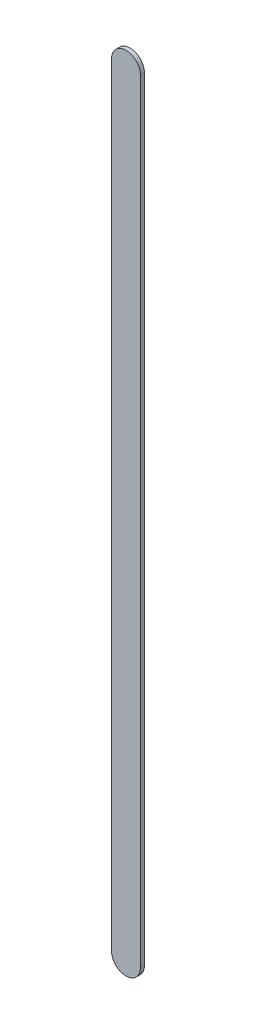
ISO-10303-21;
HEADER;
FILE_DESCRIPTION(('STEP AP214'),'2;1');
FILE_NAME('part.step','',(''),(''),'','','');
FILE_SCHEMA(('AUTOMOTIVE_DESIGN { 1 0 10303 214 1 1 1 1 }'));
ENDSEC;
DATA;
#1=APPLICATION_CONTEXT('core data for automotive mechanical design processes');
#2=APPLICATION_PROTOCOL_DEFINITION('international standard','automotive_design',2000,#1);
#3=PRODUCT_CONTEXT('',#1,'mechanical');
#4=PRODUCT('Part','Part','',(#3));
#5=PRODUCT_RELATED_PRODUCT_CATEGORY('part','',(#4));
#6=PRODUCT_DEFINITION_FORMATION('','',#4);
#7=PRODUCT_DEFINITION_CONTEXT('part definition',#1,'design');
#8=PRODUCT_DEFINITION('design','',#6,#7);
#9=PRODUCT_DEFINITION_SHAPE('','',#8);
#10=(LENGTH_UNIT() NAMED_UNIT(*) SI_UNIT(.MILLI.,.METRE.));
#11=(NAMED_UNIT(*) PLANE_ANGLE_UNIT() SI_UNIT($,.RADIAN.));
#12=(NAMED_UNIT(*) SI_UNIT($,.STERADIAN.) SOLID_ANGLE_UNIT());
#13=UNCERTAINTY_MEASURE_WITH_UNIT(LENGTH_MEASURE(1.E-05),#10,'distance_accuracy_value','');
#14=(GEOMETRIC_REPRESENTATION_CONTEXT(3) GLOBAL_UNCERTAINTY_ASSIGNED_CONTEXT((#13)) GLOBAL_UNIT_ASSIGNED_CONTEXT((#10,
#11,#12)) REPRESENTATION_CONTEXT('',''));
#15=CARTESIAN_POINT('',(0.,0.,0.));
#16=DIRECTION('',(0.,0.,1.));
#17=DIRECTION('',(1.,0.,0.));
#18=AXIS2_PLACEMENT_3D('',#15,#16,#17);
#19=CARTESIAN_POINT('',(86.7970197,94.13392654,0.));
#20=DIRECTION('',(-1.,0.,0.));
#21=DIRECTION('',(0.,1.,0.));
#22=AXIS2_PLACEMENT_3D('',#19,#20,#21);
#23=PLANE('',#22);
#24=DIRECTION('',(0.,1.,0.));
#25=VECTOR('',#24,1.);
#26=CARTESIAN_POINT('',(86.7970197,94.13392654,0.03556));
#27=LINE('',#26,#25);
#28=CARTESIAN_POINT('',(86.7970197,94.13392654,0.03556));
#29=VERTEX_POINT('',#28);
#30=CARTESIAN_POINT('',(86.7970197,100.93553854,0.03556));
#31=VERTEX_POINT('',#30);
#32=EDGE_CURVE('E11',#29,#31,#27,.T.);
#33=ORIENTED_EDGE('',*,*,#32,.F.);
#34=DIRECTION('',(0.,0.,1.));
#35=VECTOR('',#34,1.);
#36=CARTESIAN_POINT('',(86.7970197,94.13392654,0.));
#37=LINE('',#36,#35);
#38=CARTESIAN_POINT('',(86.7970197,94.13392654,0.));
#39=VERTEX_POINT('',#38);
#40=EDGE_CURVE('E24',#39,#29,#37,.T.);
#41=ORIENTED_EDGE('',*,*,#40,.F.);
#42=DIRECTION('',(0.,1.,0.));
#43=VECTOR('',#42,1.);
#44=CARTESIAN_POINT('',(86.7970197,94.13392654,0.));
#45=LINE('',#44,#43);
#46=CARTESIAN_POINT('',(86.7970197,100.93553854,0.));
#47=VERTEX_POINT('',#46);
#48=EDGE_CURVE('E75',#39,#47,#45,.T.);
#49=ORIENTED_EDGE('',*,*,#48,.T.);
#50=DIRECTION('',(0.,0.,1.));
#51=VECTOR('',#50,1.);
#52=CARTESIAN_POINT('',(86.7970197,100.93553854,0.));
#53=LINE('',#52,#51);
#54=EDGE_CURVE('E37',#47,#31,#53,.T.);
#55=ORIENTED_EDGE('',*,*,#54,.T.);
#56=EDGE_LOOP('',(#33,#41,#49,#55));
#57=FACE_BOUND('',#56,.T.);
#58=ADVANCED_FACE('F17',(#57),#23,.F.);
#59=CARTESIAN_POINT('',(86.6700197,100.93553854,0.));
#60=DIRECTION('',(0.,0.,-1.));
#61=DIRECTION('',(1.,1.1189649382048E-13,0.));
#62=AXIS2_PLACEMENT_3D('',#59,#60,#61);
#63=CYLINDRICAL_SURFACE('',#62,0.127000000000005);
#64=CARTESIAN_POINT('',(86.6700197,100.93553854,0.03556));
#65=DIRECTION('',(0.,0.,1.));
#66=DIRECTION('',(1.,1.1189649382048E-13,0.));
#67=AXIS2_PLACEMENT_3D('',#64,#65,#66);
#68=CIRCLE('',#67,0.127000000000005);
#69=CARTESIAN_POINT('',(86.5430197,100.93553854,0.03556));
#70=VERTEX_POINT('',#69);
#71=EDGE_CURVE('E83',#31,#70,#68,.T.);
#72=ORIENTED_EDGE('',*,*,#71,.F.);
#73=ORIENTED_EDGE('',*,*,#54,.F.);
#74=CARTESIAN_POINT('',(86.6700197,100.93553854,0.));
#75=DIRECTION('',(0.,0.,1.));
#76=DIRECTION('',(1.,1.1189649382048E-13,0.));
#77=AXIS2_PLACEMENT_3D('',#74,#75,#76);
#78=CIRCLE('',#77,0.127000000000005);
#79=CARTESIAN_POINT('',(86.5430197,100.93553854,0.));
#80=VERTEX_POINT('',#79);
#81=EDGE_CURVE('E81',#47,#80,#78,.T.);
#82=ORIENTED_EDGE('',*,*,#81,.T.);
#83=DIRECTION('',(0.,0.,1.));
#84=VECTOR('',#83,1.);
#85=CARTESIAN_POINT('',(86.5430197,100.93553854,0.));
#86=LINE('',#85,#84);
#87=EDGE_CURVE('E67',#80,#70,#86,.T.);
#88=ORIENTED_EDGE('',*,*,#87,.T.);
#89=EDGE_LOOP('',(#72,#73,#82,#88));
#90=FACE_BOUND('',#89,.T.);
#91=ADVANCED_FACE('F89',(#90),#63,.T.);
#92=CARTESIAN_POINT('',(86.5430197,100.93553854,0.));
#93=DIRECTION('',(1.,0.,0.));
#94=DIRECTION('',(0.,-1.,0.));
#95=AXIS2_PLACEMENT_3D('',#92,#93,#94);
#96=PLANE('',#95);
#97=DIRECTION('',(0.,-1.,0.));
#98=VECTOR('',#97,1.);
#99=CARTESIAN_POINT('',(86.5430197,100.93553854,0.03556));
#100=LINE('',#99,#98);
#101=CARTESIAN_POINT('',(86.5430197,94.13392654,0.03556));
#102=VERTEX_POINT('',#101);
#103=EDGE_CURVE('E71',#70,#102,#100,.T.);
#104=ORIENTED_EDGE('',*,*,#103,.F.);
#105=ORIENTED_EDGE('',*,*,#87,.F.);
#106=DIRECTION('',(0.,-1.,0.));
#107=VECTOR('',#106,1.);
#108=CARTESIAN_POINT('',(86.5430197,100.93553854,0.));
#109=LINE('',#108,#107);
#110=CARTESIAN_POINT('',(86.5430197,94.13392654,0.));
#111=VERTEX_POINT('',#110);
#112=EDGE_CURVE('E63',#80,#111,#109,.T.);
#113=ORIENTED_EDGE('',*,*,#112,.T.);
#114=DIRECTION('',(0.,0.,1.));
#115=VECTOR('',#114,1.);
#116=CARTESIAN_POINT('',(86.5430197,94.13392654,0.));
#117=LINE('',#116,#115);
#118=EDGE_CURVE('E53',#111,#102,#117,.T.);
#119=ORIENTED_EDGE('',*,*,#118,.T.);
#120=EDGE_LOOP('',(#104,#105,#113,#119));
#121=FACE_BOUND('',#120,.T.);
#122=ADVANCED_FACE('F66',(#121),#96,.F.);
#123=CARTESIAN_POINT('',(86.6700197,94.13392654,0.));
#124=DIRECTION('',(0.,0.,-1.));
#125=DIRECTION('',(-1.,-1.11896493820492E-13,0.));
#126=AXIS2_PLACEMENT_3D('',#123,#124,#125);
#127=CYLINDRICAL_SURFACE('',#126,0.127000000000005);
#128=CARTESIAN_POINT('',(86.6700197,94.13392654,0.03556));
#129=DIRECTION('',(0.,0.,1.));
#130=DIRECTION('',(-1.,-1.11896493820492E-13,0.));
#131=AXIS2_PLACEMENT_3D('',#128,#129,#130);
#132=CIRCLE('',#131,0.127000000000005);
#133=EDGE_CURVE('E59',#102,#29,#132,.T.);
#134=ORIENTED_EDGE('',*,*,#133,.F.);
#135=ORIENTED_EDGE('',*,*,#118,.F.);
#136=CARTESIAN_POINT('',(86.6700197,94.13392654,0.));
#137=DIRECTION('',(0.,0.,1.));
#138=DIRECTION('',(-1.,-1.11896493820492E-13,0.));
#139=AXIS2_PLACEMENT_3D('',#136,#137,#138);
#140=CIRCLE('',#139,0.127000000000005);
#141=EDGE_CURVE('E57',#111,#39,#140,.T.);
#142=ORIENTED_EDGE('',*,*,#141,.T.);
#143=ORIENTED_EDGE('',*,*,#40,.T.);
#144=EDGE_LOOP('',(#134,#135,#142,#143));
#145=FACE_BOUND('',#144,.T.);
#146=ADVANCED_FACE('F55',(#145),#127,.T.);
#147=CARTESIAN_POINT('',(86.7970197,94.13392654,0.));
#148=DIRECTION('',(0.,0.,-1.));
#149=DIRECTION('',(-1.,0.,0.));
#150=AXIS2_PLACEMENT_3D('',#147,#148,#149);
#151=PLANE('',#150);
#152=ORIENTED_EDGE('',*,*,#141,.F.);
#153=ORIENTED_EDGE('',*,*,#112,.F.);
#154=ORIENTED_EDGE('',*,*,#81,.F.);
#155=ORIENTED_EDGE('',*,*,#48,.F.);
#156=EDGE_LOOP('',(#152,#153,#154,#155));
#157=FACE_BOUND('',#156,.T.);
#158=ADVANCED_FACE('F74',(#157),#151,.T.);
#159=CARTESIAN_POINT('',(86.7970197,94.13392654,0.03556));
#160=DIRECTION('',(0.,0.,-1.));
#161=DIRECTION('',(-1.,0.,0.));
#162=AXIS2_PLACEMENT_3D('',#159,#160,#161);
#163=PLANE('',#162);
#164=ORIENTED_EDGE('',*,*,#32,.T.);
#165=ORIENTED_EDGE('',*,*,#71,.T.);
#166=ORIENTED_EDGE('',*,*,#103,.T.);
#167=ORIENTED_EDGE('',*,*,#133,.T.);
#168=EDGE_LOOP('',(#164,#165,#166,#167));
#169=FACE_BOUND('',#168,.T.);
#170=ADVANCED_FACE('F91',(#169),#163,.F.);
#171=CLOSED_SHELL('',(#58,#91,#122,#146,#158,#170));
#172=MANIFOLD_SOLID_BREP('B1',#171);
#173=ADVANCED_BREP_SHAPE_REPRESENTATION('',(#18,#172),#14);
#174=SHAPE_DEFINITION_REPRESENTATION(#9,#173);
ENDSEC;
END-ISO-10303-21;
